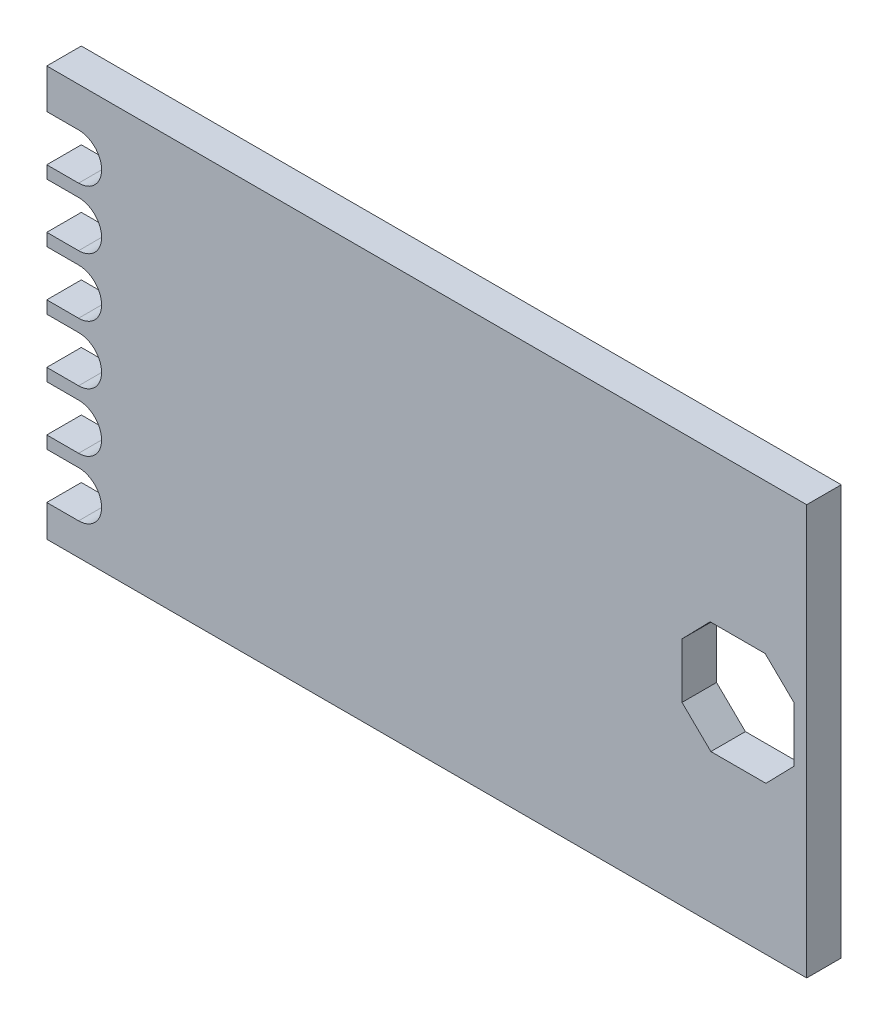
ISO-10303-21;
HEADER;
FILE_DESCRIPTION(('STEP AP214'),'2;1');
FILE_NAME('part.step','',(''),(''),'','','');
FILE_SCHEMA(('AUTOMOTIVE_DESIGN { 1 0 10303 214 1 1 1 1 }'));
ENDSEC;
DATA;
#1=APPLICATION_CONTEXT('core data for automotive mechanical design processes');
#2=APPLICATION_PROTOCOL_DEFINITION('international standard','automotive_design',2000,#1);
#3=PRODUCT_CONTEXT('',#1,'mechanical');
#4=PRODUCT('Part','Part','',(#3));
#5=PRODUCT_RELATED_PRODUCT_CATEGORY('part','',(#4));
#6=PRODUCT_DEFINITION_FORMATION('','',#4);
#7=PRODUCT_DEFINITION_CONTEXT('part definition',#1,'design');
#8=PRODUCT_DEFINITION('design','',#6,#7);
#9=PRODUCT_DEFINITION_SHAPE('','',#8);
#10=(LENGTH_UNIT() NAMED_UNIT(*) SI_UNIT(.MILLI.,.METRE.));
#11=(NAMED_UNIT(*) PLANE_ANGLE_UNIT() SI_UNIT($,.RADIAN.));
#12=(NAMED_UNIT(*) SI_UNIT($,.STERADIAN.) SOLID_ANGLE_UNIT());
#13=UNCERTAINTY_MEASURE_WITH_UNIT(LENGTH_MEASURE(1.E-05),#10,'distance_accuracy_value','');
#14=(GEOMETRIC_REPRESENTATION_CONTEXT(3) GLOBAL_UNCERTAINTY_ASSIGNED_CONTEXT((#13)) GLOBAL_UNIT_ASSIGNED_CONTEXT((#10,
#11,#12)) REPRESENTATION_CONTEXT('',''));
#15=CARTESIAN_POINT('',(0.,0.,0.));
#16=DIRECTION('',(0.,0.,1.));
#17=DIRECTION('',(1.,0.,0.));
#18=AXIS2_PLACEMENT_3D('',#15,#16,#17);
#19=CARTESIAN_POINT('',(0.,0.,1.5));
#20=DIRECTION('',(0.,0.,-1.));
#21=DIRECTION('',(-1.,0.,0.));
#22=AXIS2_PLACEMENT_3D('',#19,#20,#21);
#23=PLANE('',#22);
#24=DIRECTION('',(-1.,0.,0.));
#25=VECTOR('',#24,1.);
#26=CARTESIAN_POINT('',(0.,3.38416939249342,1.5));
#27=LINE('',#26,#25);
#28=CARTESIAN_POINT('',(1.38176013308562,3.38416939249342,1.5));
#29=VERTEX_POINT('',#28);
#30=CARTESIAN_POINT('',(0.,3.38416939249342,1.5));
#31=VERTEX_POINT('',#30);
#32=EDGE_CURVE('E326',#29,#31,#27,.T.);
#33=ORIENTED_EDGE('',*,*,#32,.F.);
#34=CARTESIAN_POINT('',(1.38176013308562,2.38416939249342,1.5));
#35=DIRECTION('',(0.,0.,-1.));
#36=DIRECTION('',(-1.,0.,0.));
#37=AXIS2_PLACEMENT_3D('',#34,#35,#36);
#38=CIRCLE('',#37,1.);
#39=CARTESIAN_POINT('',(1.38176013308562,1.38416939249342,1.5));
#40=VERTEX_POINT('',#39);
#41=EDGE_CURVE('E328',#29,#40,#38,.T.);
#42=ORIENTED_EDGE('',*,*,#41,.T.);
#43=DIRECTION('',(-1.,0.,0.));
#44=VECTOR('',#43,1.);
#45=CARTESIAN_POINT('',(0.,1.38416939249342,1.5));
#46=LINE('',#45,#44);
#47=CARTESIAN_POINT('',(0.,1.38416939249342,1.5));
#48=VERTEX_POINT('',#47);
#49=EDGE_CURVE('E322',#40,#48,#46,.T.);
#50=ORIENTED_EDGE('',*,*,#49,.T.);
#51=DIRECTION('',(0.,-1.,0.));
#52=VECTOR('',#51,1.);
#53=CARTESIAN_POINT('',(0.,0.,1.5));
#54=LINE('',#53,#52);
#55=CARTESIAN_POINT('',(0.,0.,1.5));
#56=VERTEX_POINT('',#55);
#57=EDGE_CURVE('E448',#48,#56,#54,.T.);
#58=ORIENTED_EDGE('',*,*,#57,.T.);
#59=DIRECTION('',(1.,0.,0.));
#60=VECTOR('',#59,1.);
#61=CARTESIAN_POINT('',(0.,0.,1.5));
#62=LINE('',#61,#60);
#63=CARTESIAN_POINT('',(33.,0.,1.5));
#64=VERTEX_POINT('',#63);
#65=EDGE_CURVE('E446',#56,#64,#62,.T.);
#66=ORIENTED_EDGE('',*,*,#65,.T.);
#67=DIRECTION('',(0.,1.,0.));
#68=VECTOR('',#67,1.);
#69=CARTESIAN_POINT('',(33.,0.,1.5));
#70=LINE('',#69,#68);
#71=CARTESIAN_POINT('',(33.,17.8,1.5));
#72=VERTEX_POINT('',#71);
#73=EDGE_CURVE('E450',#64,#72,#70,.T.);
#74=ORIENTED_EDGE('',*,*,#73,.T.);
#75=DIRECTION('',(-1.,0.,0.));
#76=VECTOR('',#75,1.);
#77=CARTESIAN_POINT('',(0.,17.8,1.5));
#78=LINE('',#77,#76);
#79=CARTESIAN_POINT('',(0.,17.8,1.5));
#80=VERTEX_POINT('',#79);
#81=EDGE_CURVE('E452',#72,#80,#78,.T.);
#82=ORIENTED_EDGE('',*,*,#81,.T.);
#83=CARTESIAN_POINT('',(0.,16.0841693924934,1.5));
#84=VERTEX_POINT('',#83);
#85=EDGE_CURVE('E443',#80,#84,#54,.T.);
#86=ORIENTED_EDGE('',*,*,#85,.T.);
#87=DIRECTION('',(1.,0.,0.));
#88=VECTOR('',#87,1.);
#89=CARTESIAN_POINT('',(0.,16.0841693924934,1.5));
#90=LINE('',#89,#88);
#91=CARTESIAN_POINT('',(1.38176013308566,16.0841693924934,1.5));
#92=VERTEX_POINT('',#91);
#93=EDGE_CURVE('E439',#84,#92,#90,.T.);
#94=ORIENTED_EDGE('',*,*,#93,.T.);
#95=CARTESIAN_POINT('',(1.38176013308567,15.0841693924934,1.5));
#96=DIRECTION('',(0.,0.,-1.));
#97=DIRECTION('',(-1.,0.,0.));
#98=AXIS2_PLACEMENT_3D('',#95,#96,#97);
#99=CIRCLE('',#98,1.);
#100=CARTESIAN_POINT('',(1.38176013308567,14.0841693924934,1.5));
#101=VERTEX_POINT('',#100);
#102=EDGE_CURVE('E437',#101,#92,#99,.F.);
#103=ORIENTED_EDGE('',*,*,#102,.F.);
#104=DIRECTION('',(1.,0.,0.));
#105=VECTOR('',#104,1.);
#106=CARTESIAN_POINT('',(0.,14.0841693924934,1.5));
#107=LINE('',#106,#105);
#108=CARTESIAN_POINT('',(0.,14.0841693924934,1.5));
#109=VERTEX_POINT('',#108);
#110=EDGE_CURVE('E420',#109,#101,#107,.T.);
#111=ORIENTED_EDGE('',*,*,#110,.F.);
#112=CARTESIAN_POINT('',(0.,13.5441693924934,1.5));
#113=VERTEX_POINT('',#112);
#114=EDGE_CURVE('E447',#109,#113,#54,.T.);
#115=ORIENTED_EDGE('',*,*,#114,.T.);
#116=DIRECTION('',(-1.,0.,0.));
#117=VECTOR('',#116,1.);
#118=CARTESIAN_POINT('',(0.,13.5441693924934,1.5));
#119=LINE('',#118,#117);
#120=CARTESIAN_POINT('',(1.38176013308566,13.5441693924934,1.5));
#121=VERTEX_POINT('',#120);
#122=EDGE_CURVE('E415',#121,#113,#119,.T.);
#123=ORIENTED_EDGE('',*,*,#122,.F.);
#124=CARTESIAN_POINT('',(1.38176013308566,12.5441693924934,1.5));
#125=DIRECTION('',(0.,0.,-1.));
#126=DIRECTION('',(-1.,0.,0.));
#127=AXIS2_PLACEMENT_3D('',#124,#125,#126);
#128=CIRCLE('',#127,1.);
#129=CARTESIAN_POINT('',(1.38176013308566,11.5441693924934,1.5));
#130=VERTEX_POINT('',#129);
#131=EDGE_CURVE('E402',#121,#130,#128,.T.);
#132=ORIENTED_EDGE('',*,*,#131,.T.);
#133=DIRECTION('',(-1.,0.,0.));
#134=VECTOR('',#133,1.);
#135=CARTESIAN_POINT('',(0.,11.5441693924934,1.5));
#136=LINE('',#135,#134);
#137=CARTESIAN_POINT('',(0.,11.5441693924934,1.5));
#138=VERTEX_POINT('',#137);
#139=EDGE_CURVE('E412',#130,#138,#136,.T.);
#140=ORIENTED_EDGE('',*,*,#139,.T.);
#141=CARTESIAN_POINT('',(0.,11.0041693924934,1.5));
#142=VERTEX_POINT('',#141);
#143=EDGE_CURVE('E629',#138,#142,#54,.T.);
#144=ORIENTED_EDGE('',*,*,#143,.T.);
#145=DIRECTION('',(-1.,0.,0.));
#146=VECTOR('',#145,1.);
#147=CARTESIAN_POINT('',(0.,11.0041693924934,1.5));
#148=LINE('',#147,#146);
#149=CARTESIAN_POINT('',(1.38176013308565,11.0041693924934,1.5));
#150=VERTEX_POINT('',#149);
#151=EDGE_CURVE('E386',#150,#142,#148,.T.);
#152=ORIENTED_EDGE('',*,*,#151,.F.);
#153=CARTESIAN_POINT('',(1.38176013308565,10.0041693924934,1.5));
#154=DIRECTION('',(0.,0.,-1.));
#155=DIRECTION('',(-1.,0.,0.));
#156=AXIS2_PLACEMENT_3D('',#153,#154,#155);
#157=CIRCLE('',#156,1.);
#158=CARTESIAN_POINT('',(1.38176013308565,9.00416939249342,1.5));
#159=VERTEX_POINT('',#158);
#160=EDGE_CURVE('E388',#150,#159,#157,.T.);
#161=ORIENTED_EDGE('',*,*,#160,.T.);
#162=DIRECTION('',(-1.,0.,0.));
#163=VECTOR('',#162,1.);
#164=CARTESIAN_POINT('',(0.,9.00416939249342,1.5));
#165=LINE('',#164,#163);
#166=CARTESIAN_POINT('',(0.,9.00416939249342,1.5));
#167=VERTEX_POINT('',#166);
#168=EDGE_CURVE('E382',#159,#167,#165,.T.);
#169=ORIENTED_EDGE('',*,*,#168,.T.);
#170=CARTESIAN_POINT('',(0.,8.46416939249342,1.5));
#171=VERTEX_POINT('',#170);
#172=EDGE_CURVE('E630',#167,#171,#54,.T.);
#173=ORIENTED_EDGE('',*,*,#172,.T.);
#174=DIRECTION('',(-1.,0.,0.));
#175=VECTOR('',#174,1.);
#176=CARTESIAN_POINT('',(0.,8.46416939249342,1.5));
#177=LINE('',#176,#175);
#178=CARTESIAN_POINT('',(1.38176013308564,8.46416939249342,1.5));
#179=VERTEX_POINT('',#178);
#180=EDGE_CURVE('E366',#179,#171,#177,.T.);
#181=ORIENTED_EDGE('',*,*,#180,.F.);
#182=CARTESIAN_POINT('',(1.38176013308564,7.46416939249342,1.5));
#183=DIRECTION('',(0.,0.,-1.));
#184=DIRECTION('',(-1.,0.,0.));
#185=AXIS2_PLACEMENT_3D('',#182,#183,#184);
#186=CIRCLE('',#185,1.);
#187=CARTESIAN_POINT('',(1.38176013308564,6.46416939249342,1.5));
#188=VERTEX_POINT('',#187);
#189=EDGE_CURVE('E368',#179,#188,#186,.T.);
#190=ORIENTED_EDGE('',*,*,#189,.T.);
#191=DIRECTION('',(-1.,0.,0.));
#192=VECTOR('',#191,1.);
#193=CARTESIAN_POINT('',(0.,6.46416939249342,1.5));
#194=LINE('',#193,#192);
#195=CARTESIAN_POINT('',(0.,6.46416939249342,1.5));
#196=VERTEX_POINT('',#195);
#197=EDGE_CURVE('E362',#188,#196,#194,.T.);
#198=ORIENTED_EDGE('',*,*,#197,.T.);
#199=CARTESIAN_POINT('',(0.,5.92416939249342,1.5));
#200=VERTEX_POINT('',#199);
#201=EDGE_CURVE('E633',#196,#200,#54,.T.);
#202=ORIENTED_EDGE('',*,*,#201,.T.);
#203=DIRECTION('',(-1.,0.,0.));
#204=VECTOR('',#203,1.);
#205=CARTESIAN_POINT('',(0.,5.92416939249342,1.5));
#206=LINE('',#205,#204);
#207=CARTESIAN_POINT('',(1.38176013308563,5.92416939249342,1.5));
#208=VERTEX_POINT('',#207);
#209=EDGE_CURVE('E346',#208,#200,#206,.T.);
#210=ORIENTED_EDGE('',*,*,#209,.F.);
#211=CARTESIAN_POINT('',(1.38176013308563,4.92416939249342,1.5));
#212=DIRECTION('',(0.,0.,-1.));
#213=DIRECTION('',(-1.,0.,0.));
#214=AXIS2_PLACEMENT_3D('',#211,#212,#213);
#215=CIRCLE('',#214,1.);
#216=CARTESIAN_POINT('',(1.38176013308563,3.92416939249342,1.5));
#217=VERTEX_POINT('',#216);
#218=EDGE_CURVE('E348',#208,#217,#215,.T.);
#219=ORIENTED_EDGE('',*,*,#218,.T.);
#220=DIRECTION('',(-1.,0.,0.));
#221=VECTOR('',#220,1.);
#222=CARTESIAN_POINT('',(0.,3.92416939249342,1.5));
#223=LINE('',#222,#221);
#224=CARTESIAN_POINT('',(0.,3.92416939249342,1.5));
#225=VERTEX_POINT('',#224);
#226=EDGE_CURVE('E342',#217,#225,#223,.T.);
#227=ORIENTED_EDGE('',*,*,#226,.T.);
#228=EDGE_CURVE('E637',#225,#31,#54,.T.);
#229=ORIENTED_EDGE('',*,*,#228,.T.);
#230=EDGE_LOOP('',(#33,#42,#50,#58,#66,#74,#82,#86,#94,#103,#111,#115,#123,#132,#140,#144,#152,
#161,#169,#173,#181,#190,#198,#202,#210,#219,#227,#229));
#231=FACE_BOUND('',#230,.T.);
#232=DIRECTION('',(-0.697780575083329,-0.716311572596994,0.));
#233=VECTOR('',#232,1.);
#234=CARTESIAN_POINT('',(31.2288839936042,6.43562770116437,1.5));
#235=LINE('',#234,#233);
#236=CARTESIAN_POINT('',(32.45,7.68917295320911,1.5));
#237=VERTEX_POINT('',#236);
#238=CARTESIAN_POINT('',(31.2288839936042,6.43562770116437,1.5));
#239=VERTEX_POINT('',#238);
#240=EDGE_CURVE('E48',#237,#239,#235,.T.);
#241=ORIENTED_EDGE('',*,*,#240,.T.);
#242=DIRECTION('',(-1.,0.,0.));
#243=VECTOR('',#242,1.);
#244=CARTESIAN_POINT('',(28.8391729532091,6.43562770116437,1.5));
#245=LINE('',#244,#243);
#246=CARTESIAN_POINT('',(28.8391729532091,6.43562770116437,1.5));
#247=VERTEX_POINT('',#246);
#248=EDGE_CURVE('E274',#239,#247,#245,.T.);
#249=ORIENTED_EDGE('',*,*,#248,.T.);
#250=DIRECTION('',(-0.716311572596995,0.697780575083328,0.));
#251=VECTOR('',#250,1.);
#252=CARTESIAN_POINT('',(28.8391729532091,6.43562770116437,1.5));
#253=LINE('',#252,#251);
#254=CARTESIAN_POINT('',(27.5856277011644,7.65674370756019,1.5));
#255=VERTEX_POINT('',#254);
#256=EDGE_CURVE('E280',#247,#255,#253,.T.);
#257=ORIENTED_EDGE('',*,*,#256,.T.);
#258=DIRECTION('',(0.,1.,0.));
#259=VECTOR('',#258,1.);
#260=CARTESIAN_POINT('',(27.5856277011644,7.65674370756019,1.5));
#261=LINE('',#260,#259);
#262=CARTESIAN_POINT('',(27.5856277011644,10.0464547479553,1.5));
#263=VERTEX_POINT('',#262);
#264=EDGE_CURVE('E288',#255,#263,#261,.T.);
#265=ORIENTED_EDGE('',*,*,#264,.T.);
#266=DIRECTION('',(0.697780575083328,0.716311572596995,0.));
#267=VECTOR('',#266,1.);
#268=CARTESIAN_POINT('',(28.8067437075602,11.3,1.5));
#269=LINE('',#268,#267);
#270=CARTESIAN_POINT('',(28.8067437075602,11.3,1.5));
#271=VERTEX_POINT('',#270);
#272=EDGE_CURVE('E291',#263,#271,#269,.T.);
#273=ORIENTED_EDGE('',*,*,#272,.T.);
#274=DIRECTION('',(1.,0.,0.));
#275=VECTOR('',#274,1.);
#276=CARTESIAN_POINT('',(28.8067437075602,11.3,1.5));
#277=LINE('',#276,#275);
#278=CARTESIAN_POINT('',(31.1964547479553,11.3,1.5));
#279=VERTEX_POINT('',#278);
#280=EDGE_CURVE('E294',#271,#279,#277,.T.);
#281=ORIENTED_EDGE('',*,*,#280,.T.);
#282=DIRECTION('',(0.716311572596994,-0.697780575083329,0.));
#283=VECTOR('',#282,1.);
#284=CARTESIAN_POINT('',(32.45,10.0788839936042,1.5));
#285=LINE('',#284,#283);
#286=CARTESIAN_POINT('',(32.45,10.0788839936042,1.5));
#287=VERTEX_POINT('',#286);
#288=EDGE_CURVE('E297',#279,#287,#285,.T.);
#289=ORIENTED_EDGE('',*,*,#288,.T.);
#290=DIRECTION('',(0.,-1.,0.));
#291=VECTOR('',#290,1.);
#292=CARTESIAN_POINT('',(32.45,7.68917295320911,1.5));
#293=LINE('',#292,#291);
#294=EDGE_CURVE('E284',#287,#237,#293,.T.);
#295=ORIENTED_EDGE('',*,*,#294,.T.);
#296=EDGE_LOOP('',(#241,#249,#257,#265,#273,#281,#289,#295));
#297=FACE_BOUND('',#296,.T.);
#298=ADVANCED_FACE('F33',(#231,#297),#23,.F.);
#299=CARTESIAN_POINT('',(0.,0.,0.));
#300=DIRECTION('',(0.,0.,-1.));
#301=DIRECTION('',(-1.,0.,0.));
#302=AXIS2_PLACEMENT_3D('',#299,#300,#301);
#303=PLANE('',#302);
#304=CARTESIAN_POINT('',(1.38176013308562,2.38416939249342,0.));
#305=DIRECTION('',(0.,0.,-1.));
#306=DIRECTION('',(-1.,0.,0.));
#307=AXIS2_PLACEMENT_3D('',#304,#305,#306);
#308=CIRCLE('',#307,1.);
#309=CARTESIAN_POINT('',(1.38176013308562,3.38416939249342,0.));
#310=VERTEX_POINT('',#309);
#311=CARTESIAN_POINT('',(1.38176013308562,1.38416939249342,0.));
#312=VERTEX_POINT('',#311);
#313=EDGE_CURVE('E315',#310,#312,#308,.T.);
#314=ORIENTED_EDGE('',*,*,#313,.F.);
#315=DIRECTION('',(-1.,0.,0.));
#316=VECTOR('',#315,1.);
#317=CARTESIAN_POINT('',(0.,3.38416939249342,0.));
#318=LINE('',#317,#316);
#319=CARTESIAN_POINT('',(0.,3.38416939249342,0.));
#320=VERTEX_POINT('',#319);
#321=EDGE_CURVE('E270',#310,#320,#318,.T.);
#322=ORIENTED_EDGE('',*,*,#321,.T.);
#323=DIRECTION('',(0.,-1.,0.));
#324=VECTOR('',#323,1.);
#325=CARTESIAN_POINT('',(0.,0.,0.));
#326=LINE('',#325,#324);
#327=CARTESIAN_POINT('',(0.,3.92416939249342,0.));
#328=VERTEX_POINT('',#327);
#329=EDGE_CURVE('E587',#328,#320,#326,.T.);
#330=ORIENTED_EDGE('',*,*,#329,.F.);
#331=DIRECTION('',(-1.,0.,0.));
#332=VECTOR('',#331,1.);
#333=CARTESIAN_POINT('',(0.,3.92416939249342,0.));
#334=LINE('',#333,#332);
#335=CARTESIAN_POINT('',(1.38176013308563,3.92416939249342,0.));
#336=VERTEX_POINT('',#335);
#337=EDGE_CURVE('E332',#336,#328,#334,.T.);
#338=ORIENTED_EDGE('',*,*,#337,.F.);
#339=CARTESIAN_POINT('',(1.38176013308563,4.92416939249342,0.));
#340=DIRECTION('',(0.,0.,-1.));
#341=DIRECTION('',(-1.,0.,0.));
#342=AXIS2_PLACEMENT_3D('',#339,#340,#341);
#343=CIRCLE('',#342,1.);
#344=CARTESIAN_POINT('',(1.38176013308563,5.92416939249342,0.));
#345=VERTEX_POINT('',#344);
#346=EDGE_CURVE('E335',#345,#336,#343,.T.);
#347=ORIENTED_EDGE('',*,*,#346,.F.);
#348=DIRECTION('',(-1.,0.,0.));
#349=VECTOR('',#348,1.);
#350=CARTESIAN_POINT('',(0.,5.92416939249342,0.));
#351=LINE('',#350,#349);
#352=CARTESIAN_POINT('',(0.,5.92416939249342,0.));
#353=VERTEX_POINT('',#352);
#354=EDGE_CURVE('E331',#345,#353,#351,.T.);
#355=ORIENTED_EDGE('',*,*,#354,.T.);
#356=CARTESIAN_POINT('',(0.,6.46416939249342,0.));
#357=VERTEX_POINT('',#356);
#358=EDGE_CURVE('E589',#357,#353,#326,.T.);
#359=ORIENTED_EDGE('',*,*,#358,.F.);
#360=DIRECTION('',(-1.,0.,0.));
#361=VECTOR('',#360,1.);
#362=CARTESIAN_POINT('',(0.,6.46416939249342,0.));
#363=LINE('',#362,#361);
#364=CARTESIAN_POINT('',(1.38176013308564,6.46416939249342,0.));
#365=VERTEX_POINT('',#364);
#366=EDGE_CURVE('E352',#365,#357,#363,.T.);
#367=ORIENTED_EDGE('',*,*,#366,.F.);
#368=CARTESIAN_POINT('',(1.38176013308564,7.46416939249342,0.));
#369=DIRECTION('',(0.,0.,-1.));
#370=DIRECTION('',(-1.,0.,0.));
#371=AXIS2_PLACEMENT_3D('',#368,#369,#370);
#372=CIRCLE('',#371,1.);
#373=CARTESIAN_POINT('',(1.38176013308564,8.46416939249342,0.));
#374=VERTEX_POINT('',#373);
#375=EDGE_CURVE('E355',#374,#365,#372,.T.);
#376=ORIENTED_EDGE('',*,*,#375,.F.);
#377=DIRECTION('',(-1.,0.,0.));
#378=VECTOR('',#377,1.);
#379=CARTESIAN_POINT('',(0.,8.46416939249342,0.));
#380=LINE('',#379,#378);
#381=CARTESIAN_POINT('',(0.,8.46416939249342,0.));
#382=VERTEX_POINT('',#381);
#383=EDGE_CURVE('E351',#374,#382,#380,.T.);
#384=ORIENTED_EDGE('',*,*,#383,.T.);
#385=CARTESIAN_POINT('',(0.,9.00416939249342,0.));
#386=VERTEX_POINT('',#385);
#387=EDGE_CURVE('E594',#386,#382,#326,.T.);
#388=ORIENTED_EDGE('',*,*,#387,.F.);
#389=DIRECTION('',(-1.,0.,0.));
#390=VECTOR('',#389,1.);
#391=CARTESIAN_POINT('',(0.,9.00416939249342,0.));
#392=LINE('',#391,#390);
#393=CARTESIAN_POINT('',(1.38176013308565,9.00416939249342,0.));
#394=VERTEX_POINT('',#393);
#395=EDGE_CURVE('E372',#394,#386,#392,.T.);
#396=ORIENTED_EDGE('',*,*,#395,.F.);
#397=CARTESIAN_POINT('',(1.38176013308565,10.0041693924934,0.));
#398=DIRECTION('',(0.,0.,-1.));
#399=DIRECTION('',(-1.,0.,0.));
#400=AXIS2_PLACEMENT_3D('',#397,#398,#399);
#401=CIRCLE('',#400,1.);
#402=CARTESIAN_POINT('',(1.38176013308565,11.0041693924934,0.));
#403=VERTEX_POINT('',#402);
#404=EDGE_CURVE('E375',#403,#394,#401,.T.);
#405=ORIENTED_EDGE('',*,*,#404,.F.);
#406=DIRECTION('',(-1.,0.,0.));
#407=VECTOR('',#406,1.);
#408=CARTESIAN_POINT('',(0.,11.0041693924934,0.));
#409=LINE('',#408,#407);
#410=CARTESIAN_POINT('',(0.,11.0041693924934,0.));
#411=VERTEX_POINT('',#410);
#412=EDGE_CURVE('E371',#403,#411,#409,.T.);
#413=ORIENTED_EDGE('',*,*,#412,.T.);
#414=CARTESIAN_POINT('',(0.,11.5441693924934,0.));
#415=VERTEX_POINT('',#414);
#416=EDGE_CURVE('E599',#415,#411,#326,.T.);
#417=ORIENTED_EDGE('',*,*,#416,.F.);
#418=DIRECTION('',(-1.,0.,0.));
#419=VECTOR('',#418,1.);
#420=CARTESIAN_POINT('',(0.,11.5441693924934,0.));
#421=LINE('',#420,#419);
#422=CARTESIAN_POINT('',(1.38176013308566,11.5441693924934,0.));
#423=VERTEX_POINT('',#422);
#424=EDGE_CURVE('E392',#423,#415,#421,.T.);
#425=ORIENTED_EDGE('',*,*,#424,.F.);
#426=CARTESIAN_POINT('',(1.38176013308566,12.5441693924934,0.));
#427=DIRECTION('',(0.,0.,-1.));
#428=DIRECTION('',(-1.,0.,0.));
#429=AXIS2_PLACEMENT_3D('',#426,#427,#428);
#430=CIRCLE('',#429,1.);
#431=CARTESIAN_POINT('',(1.38176013308566,13.5441693924934,0.));
#432=VERTEX_POINT('',#431);
#433=EDGE_CURVE('E395',#432,#423,#430,.T.);
#434=ORIENTED_EDGE('',*,*,#433,.F.);
#435=DIRECTION('',(-1.,0.,0.));
#436=VECTOR('',#435,1.);
#437=CARTESIAN_POINT('',(0.,13.5441693924934,0.));
#438=LINE('',#437,#436);
#439=CARTESIAN_POINT('',(0.,13.5441693924934,0.));
#440=VERTEX_POINT('',#439);
#441=EDGE_CURVE('E391',#432,#440,#438,.T.);
#442=ORIENTED_EDGE('',*,*,#441,.T.);
#443=CARTESIAN_POINT('',(0.,14.0841693924934,0.));
#444=VERTEX_POINT('',#443);
#445=EDGE_CURVE('E459',#444,#440,#326,.T.);
#446=ORIENTED_EDGE('',*,*,#445,.F.);
#447=DIRECTION('',(-1.,0.,0.));
#448=VECTOR('',#447,1.);
#449=CARTESIAN_POINT('',(0.,14.0841693924934,0.));
#450=LINE('',#449,#448);
#451=CARTESIAN_POINT('',(1.38176013308567,14.0841693924934,0.));
#452=VERTEX_POINT('',#451);
#453=EDGE_CURVE('E418',#452,#444,#450,.T.);
#454=ORIENTED_EDGE('',*,*,#453,.F.);
#455=CARTESIAN_POINT('',(1.38176013308567,15.0841693924934,0.));
#456=DIRECTION('',(0.,0.,-1.));
#457=DIRECTION('',(-1.,0.,0.));
#458=AXIS2_PLACEMENT_3D('',#455,#456,#457);
#459=CIRCLE('',#458,1.);
#460=CARTESIAN_POINT('',(1.38176013308566,16.0841693924934,0.));
#461=VERTEX_POINT('',#460);
#462=EDGE_CURVE('E421',#461,#452,#459,.T.);
#463=ORIENTED_EDGE('',*,*,#462,.F.);
#464=DIRECTION('',(-1.,0.,0.));
#465=VECTOR('',#464,1.);
#466=CARTESIAN_POINT('',(0.,16.0841693924934,0.));
#467=LINE('',#466,#465);
#468=CARTESIAN_POINT('',(0.,16.0841693924934,0.));
#469=VERTEX_POINT('',#468);
#470=EDGE_CURVE('E417',#461,#469,#467,.T.);
#471=ORIENTED_EDGE('',*,*,#470,.T.);
#472=CARTESIAN_POINT('',(0.,17.8,0.));
#473=VERTEX_POINT('',#472);
#474=EDGE_CURVE('E455',#473,#469,#326,.T.);
#475=ORIENTED_EDGE('',*,*,#474,.F.);
#476=DIRECTION('',(-1.,0.,0.));
#477=VECTOR('',#476,1.);
#478=CARTESIAN_POINT('',(0.,17.8,0.));
#479=LINE('',#478,#477);
#480=CARTESIAN_POINT('',(33.,17.8,0.));
#481=VERTEX_POINT('',#480);
#482=EDGE_CURVE('E463',#481,#473,#479,.T.);
#483=ORIENTED_EDGE('',*,*,#482,.F.);
#484=DIRECTION('',(0.,1.,0.));
#485=VECTOR('',#484,1.);
#486=CARTESIAN_POINT('',(33.,0.,0.));
#487=LINE('',#486,#485);
#488=CARTESIAN_POINT('',(33.,0.,0.));
#489=VERTEX_POINT('',#488);
#490=EDGE_CURVE('E461',#489,#481,#487,.T.);
#491=ORIENTED_EDGE('',*,*,#490,.F.);
#492=DIRECTION('',(1.,0.,0.));
#493=VECTOR('',#492,1.);
#494=CARTESIAN_POINT('',(0.,0.,0.));
#495=LINE('',#494,#493);
#496=CARTESIAN_POINT('',(0.,0.,0.));
#497=VERTEX_POINT('',#496);
#498=EDGE_CURVE('E458',#497,#489,#495,.T.);
#499=ORIENTED_EDGE('',*,*,#498,.F.);
#500=CARTESIAN_POINT('',(0.,1.38416939249342,0.));
#501=VERTEX_POINT('',#500);
#502=EDGE_CURVE('E442',#501,#497,#326,.T.);
#503=ORIENTED_EDGE('',*,*,#502,.F.);
#504=DIRECTION('',(-1.,0.,0.));
#505=VECTOR('',#504,1.);
#506=CARTESIAN_POINT('',(0.,1.38416939249342,0.));
#507=LINE('',#506,#505);
#508=EDGE_CURVE('E312',#312,#501,#507,.T.);
#509=ORIENTED_EDGE('',*,*,#508,.F.);
#510=EDGE_LOOP('',(#314,#322,#330,#338,#347,#355,#359,#367,#376,#384,#388,#396,#405,#413,#417,
#425,#434,#442,#446,#454,#463,#471,#475,#483,#491,#499,#503,#509));
#511=FACE_BOUND('',#510,.T.);
#512=DIRECTION('',(1.,0.,0.));
#513=VECTOR('',#512,1.);
#514=CARTESIAN_POINT('',(0.,6.43562770116437,0.));
#515=LINE('',#514,#513);
#516=CARTESIAN_POINT('',(28.8391729532091,6.43562770116437,0.));
#517=VERTEX_POINT('',#516);
#518=CARTESIAN_POINT('',(31.2288839936042,6.43562770116437,0.));
#519=VERTEX_POINT('',#518);
#520=EDGE_CURVE('E41',#517,#519,#515,.T.);
#521=ORIENTED_EDGE('',*,*,#520,.T.);
#522=DIRECTION('',(0.697780575083329,0.716311572596994,0.));
#523=VECTOR('',#522,1.);
#524=CARTESIAN_POINT('',(12.8069023764286,-12.4755875056735,0.));
#525=LINE('',#524,#523);
#526=CARTESIAN_POINT('',(32.45,7.68917295320911,0.));
#527=VERTEX_POINT('',#526);
#528=EDGE_CURVE('E11',#519,#527,#525,.T.);
#529=ORIENTED_EDGE('',*,*,#528,.T.);
#530=DIRECTION('',(0.,1.,0.));
#531=VECTOR('',#530,1.);
#532=CARTESIAN_POINT('',(32.45,0.,0.));
#533=LINE('',#532,#531);
#534=CARTESIAN_POINT('',(32.45,10.0788839936042,0.));
#535=VERTEX_POINT('',#534);
#536=EDGE_CURVE('E496',#527,#535,#533,.T.);
#537=ORIENTED_EDGE('',*,*,#536,.T.);
#538=DIRECTION('',(-0.716311572596994,0.697780575083329,0.));
#539=VECTOR('',#538,1.);
#540=CARTESIAN_POINT('',(20.8375428329297,21.3909266160506,0.));
#541=LINE('',#540,#539);
#542=CARTESIAN_POINT('',(31.1964547479553,11.3,0.));
#543=VERTEX_POINT('',#542);
#544=EDGE_CURVE('E499',#535,#543,#541,.T.);
#545=ORIENTED_EDGE('',*,*,#544,.T.);
#546=DIRECTION('',(-1.,0.,0.));
#547=VECTOR('',#546,1.);
#548=CARTESIAN_POINT('',(0.,11.3,0.));
#549=LINE('',#548,#547);
#550=CARTESIAN_POINT('',(28.8067437075602,11.3,0.));
#551=VERTEX_POINT('',#550);
#552=EDGE_CURVE('E502',#543,#551,#549,.T.);
#553=ORIENTED_EDGE('',*,*,#552,.T.);
#554=DIRECTION('',(-0.697780575083328,-0.716311572596995,0.));
#555=VECTOR('',#554,1.);
#556=CARTESIAN_POINT('',(9.13274575785762,-8.89648140669233,0.));
#557=LINE('',#556,#555);
#558=CARTESIAN_POINT('',(27.5856277011644,10.0464547479553,0.));
#559=VERTEX_POINT('',#558);
#560=EDGE_CURVE('E505',#551,#559,#557,.T.);
#561=ORIENTED_EDGE('',*,*,#560,.T.);
#562=DIRECTION('',(0.,-1.,0.));
#563=VECTOR('',#562,1.);
#564=CARTESIAN_POINT('',(27.5856277011644,0.,0.));
#565=LINE('',#564,#563);
#566=CARTESIAN_POINT('',(27.5856277011644,7.65674370756019,0.));
#567=VERTEX_POINT('',#566);
#568=EDGE_CURVE('E508',#559,#567,#565,.T.);
#569=ORIENTED_EDGE('',*,*,#568,.T.);
#570=DIRECTION('',(0.716311572596995,-0.697780575083328,0.));
#571=VECTOR('',#570,1.);
#572=CARTESIAN_POINT('',(17.2584367339485,17.7167699974796,0.));
#573=LINE('',#572,#571);
#574=EDGE_CURVE('E511',#567,#517,#573,.T.);
#575=ORIENTED_EDGE('',*,*,#574,.T.);
#576=EDGE_LOOP('',(#521,#529,#537,#545,#553,#561,#569,#575));
#577=FACE_BOUND('',#576,.T.);
#578=ADVANCED_FACE('F514',(#511,#577),#303,.T.);
#579=CARTESIAN_POINT('',(0.,0.,1.5));
#580=DIRECTION('',(1.,0.,0.));
#581=DIRECTION('',(0.,0.,-1.));
#582=AXIS2_PLACEMENT_3D('',#579,#580,#581);
#583=PLANE('',#582);
#584=DIRECTION('',(0.,0.,-1.));
#585=VECTOR('',#584,1.);
#586=CARTESIAN_POINT('',(0.,3.38416939249342,1.5));
#587=LINE('',#586,#585);
#588=EDGE_CURVE('E494',#31,#320,#587,.T.);
#589=ORIENTED_EDGE('',*,*,#588,.F.);
#590=ORIENTED_EDGE('',*,*,#228,.F.);
#591=DIRECTION('',(0.,0.,-1.));
#592=VECTOR('',#591,1.);
#593=CARTESIAN_POINT('',(0.,3.92416939249342,1.5));
#594=LINE('',#593,#592);
#595=EDGE_CURVE('E486',#225,#328,#594,.T.);
#596=ORIENTED_EDGE('',*,*,#595,.T.);
#597=ORIENTED_EDGE('',*,*,#329,.T.);
#598=EDGE_LOOP('',(#589,#590,#596,#597));
#599=FACE_BOUND('',#598,.T.);
#600=ADVANCED_FACE('F546',(#599),#583,.F.);
#601=DIRECTION('',(0.,0.,-1.));
#602=VECTOR('',#601,1.);
#603=CARTESIAN_POINT('',(0.,5.92416939249342,1.5));
#604=LINE('',#603,#602);
#605=EDGE_CURVE('E489',#200,#353,#604,.T.);
#606=ORIENTED_EDGE('',*,*,#605,.F.);
#607=ORIENTED_EDGE('',*,*,#201,.F.);
#608=DIRECTION('',(0.,0.,-1.));
#609=VECTOR('',#608,1.);
#610=CARTESIAN_POINT('',(0.,6.46416939249342,1.5));
#611=LINE('',#610,#609);
#612=EDGE_CURVE('E481',#196,#357,#611,.T.);
#613=ORIENTED_EDGE('',*,*,#612,.T.);
#614=ORIENTED_EDGE('',*,*,#358,.T.);
#615=EDGE_LOOP('',(#606,#607,#613,#614));
#616=FACE_BOUND('',#615,.T.);
#617=ADVANCED_FACE('F773',(#616),#583,.F.);
#618=DIRECTION('',(0.,0.,-1.));
#619=VECTOR('',#618,1.);
#620=CARTESIAN_POINT('',(0.,8.46416939249342,1.5));
#621=LINE('',#620,#619);
#622=EDGE_CURVE('E484',#171,#382,#621,.T.);
#623=ORIENTED_EDGE('',*,*,#622,.F.);
#624=ORIENTED_EDGE('',*,*,#172,.F.);
#625=DIRECTION('',(0.,0.,-1.));
#626=VECTOR('',#625,1.);
#627=CARTESIAN_POINT('',(0.,9.00416939249342,1.5));
#628=LINE('',#627,#626);
#629=EDGE_CURVE('E476',#167,#386,#628,.T.);
#630=ORIENTED_EDGE('',*,*,#629,.T.);
#631=ORIENTED_EDGE('',*,*,#387,.T.);
#632=EDGE_LOOP('',(#623,#624,#630,#631));
#633=FACE_BOUND('',#632,.T.);
#634=ADVANCED_FACE('F765',(#633),#583,.F.);
#635=DIRECTION('',(0.,0.,-1.));
#636=VECTOR('',#635,1.);
#637=CARTESIAN_POINT('',(0.,11.0041693924934,1.5));
#638=LINE('',#637,#636);
#639=EDGE_CURVE('E479',#142,#411,#638,.T.);
#640=ORIENTED_EDGE('',*,*,#639,.F.);
#641=ORIENTED_EDGE('',*,*,#143,.F.);
#642=DIRECTION('',(0.,0.,-1.));
#643=VECTOR('',#642,1.);
#644=CARTESIAN_POINT('',(0.,11.5441693924934,11.5));
#645=LINE('',#644,#643);
#646=EDGE_CURVE('E403',#138,#415,#645,.T.);
#647=ORIENTED_EDGE('',*,*,#646,.T.);
#648=ORIENTED_EDGE('',*,*,#416,.T.);
#649=EDGE_LOOP('',(#640,#641,#647,#648));
#650=FACE_BOUND('',#649,.T.);
#651=ADVANCED_FACE('F757',(#650),#583,.F.);
#652=DIRECTION('',(0.,0.,-1.));
#653=VECTOR('',#652,1.);
#654=CARTESIAN_POINT('',(0.,13.5441693924934,11.5));
#655=LINE('',#654,#653);
#656=EDGE_CURVE('E400',#113,#440,#655,.T.);
#657=ORIENTED_EDGE('',*,*,#656,.F.);
#658=ORIENTED_EDGE('',*,*,#114,.F.);
#659=DIRECTION('',(0.,0.,1.));
#660=VECTOR('',#659,1.);
#661=CARTESIAN_POINT('',(0.,14.0841693924934,-3.11010953690642));
#662=LINE('',#661,#660);
#663=EDGE_CURVE('E423',#444,#109,#662,.T.);
#664=ORIENTED_EDGE('',*,*,#663,.F.);
#665=ORIENTED_EDGE('',*,*,#445,.T.);
#666=EDGE_LOOP('',(#657,#658,#664,#665));
#667=FACE_BOUND('',#666,.T.);
#668=ADVANCED_FACE('F612',(#667),#583,.F.);
#669=ORIENTED_EDGE('',*,*,#57,.F.);
#670=DIRECTION('',(0.,0.,-1.));
#671=VECTOR('',#670,1.);
#672=CARTESIAN_POINT('',(0.,1.38416939249342,1.5));
#673=LINE('',#672,#671);
#674=EDGE_CURVE('E491',#48,#501,#673,.T.);
#675=ORIENTED_EDGE('',*,*,#674,.T.);
#676=ORIENTED_EDGE('',*,*,#502,.T.);
#677=DIRECTION('',(0.,0.,-1.));
#678=VECTOR('',#677,1.);
#679=CARTESIAN_POINT('',(0.,0.,1.5));
#680=LINE('',#679,#678);
#681=EDGE_CURVE('E473',#56,#497,#680,.T.);
#682=ORIENTED_EDGE('',*,*,#681,.F.);
#683=EDGE_LOOP('',(#669,#675,#676,#682));
#684=FACE_BOUND('',#683,.T.);
#685=ADVANCED_FACE('F567',(#684),#583,.F.);
#686=ORIENTED_EDGE('',*,*,#474,.T.);
#687=DIRECTION('',(0.,0.,1.));
#688=VECTOR('',#687,1.);
#689=CARTESIAN_POINT('',(0.,16.0841693924934,-3.11010953690642));
#690=LINE('',#689,#688);
#691=EDGE_CURVE('E426',#469,#84,#690,.T.);
#692=ORIENTED_EDGE('',*,*,#691,.T.);
#693=ORIENTED_EDGE('',*,*,#85,.F.);
#694=DIRECTION('',(0.,0.,-1.));
#695=VECTOR('',#694,1.);
#696=CARTESIAN_POINT('',(0.,17.8,1.5));
#697=LINE('',#696,#695);
#698=EDGE_CURVE('E454',#80,#473,#697,.T.);
#699=ORIENTED_EDGE('',*,*,#698,.T.);
#700=EDGE_LOOP('',(#686,#692,#693,#699));
#701=FACE_BOUND('',#700,.T.);
#702=ADVANCED_FACE('F35',(#701),#583,.F.);
#703=CARTESIAN_POINT('',(0.,0.,1.5));
#704=DIRECTION('',(0.,1.,0.));
#705=DIRECTION('',(0.,0.,1.));
#706=AXIS2_PLACEMENT_3D('',#703,#704,#705);
#707=PLANE('',#706);
#708=ORIENTED_EDGE('',*,*,#498,.T.);
#709=DIRECTION('',(0.,0.,-1.));
#710=VECTOR('',#709,1.);
#711=CARTESIAN_POINT('',(33.,0.,1.5));
#712=LINE('',#711,#710);
#713=EDGE_CURVE('E470',#64,#489,#712,.T.);
#714=ORIENTED_EDGE('',*,*,#713,.F.);
#715=ORIENTED_EDGE('',*,*,#65,.F.);
#716=ORIENTED_EDGE('',*,*,#681,.T.);
#717=EDGE_LOOP('',(#708,#714,#715,#716));
#718=FACE_BOUND('',#717,.T.);
#719=ADVANCED_FACE('F560',(#718),#707,.F.);
#720=CARTESIAN_POINT('',(33.,0.,1.5));
#721=DIRECTION('',(-1.,0.,0.));
#722=DIRECTION('',(0.,0.,1.));
#723=AXIS2_PLACEMENT_3D('',#720,#721,#722);
#724=PLANE('',#723);
#725=ORIENTED_EDGE('',*,*,#490,.T.);
#726=DIRECTION('',(0.,0.,-1.));
#727=VECTOR('',#726,1.);
#728=CARTESIAN_POINT('',(33.,17.8,1.5));
#729=LINE('',#728,#727);
#730=EDGE_CURVE('E467',#72,#481,#729,.T.);
#731=ORIENTED_EDGE('',*,*,#730,.F.);
#732=ORIENTED_EDGE('',*,*,#73,.F.);
#733=ORIENTED_EDGE('',*,*,#713,.T.);
#734=EDGE_LOOP('',(#725,#731,#732,#733));
#735=FACE_BOUND('',#734,.T.);
#736=ADVANCED_FACE('F557',(#735),#724,.F.);
#737=CARTESIAN_POINT('',(0.,17.8,1.5));
#738=DIRECTION('',(0.,-1.,0.));
#739=DIRECTION('',(0.,0.,-1.));
#740=AXIS2_PLACEMENT_3D('',#737,#738,#739);
#741=PLANE('',#740);
#742=ORIENTED_EDGE('',*,*,#482,.T.);
#743=ORIENTED_EDGE('',*,*,#698,.F.);
#744=ORIENTED_EDGE('',*,*,#81,.F.);
#745=ORIENTED_EDGE('',*,*,#730,.T.);
#746=EDGE_LOOP('',(#742,#743,#744,#745));
#747=FACE_BOUND('',#746,.T.);
#748=ADVANCED_FACE('F554',(#747),#741,.F.);
#749=CARTESIAN_POINT('',(0.,16.0841693924934,-3.11010953690642));
#750=DIRECTION('',(0.,1.,0.));
#751=DIRECTION('',(0.,0.,1.));
#752=AXIS2_PLACEMENT_3D('',#749,#750,#751);
#753=PLANE('',#752);
#754=ORIENTED_EDGE('',*,*,#691,.F.);
#755=ORIENTED_EDGE('',*,*,#470,.F.);
#756=DIRECTION('',(0.,0.,1.));
#757=VECTOR('',#756,1.);
#758=CARTESIAN_POINT('',(1.38176013308566,16.0841693924934,-3.11010953690642));
#759=LINE('',#758,#757);
#760=EDGE_CURVE('E427',#461,#92,#759,.T.);
#761=ORIENTED_EDGE('',*,*,#760,.T.);
#762=ORIENTED_EDGE('',*,*,#93,.F.);
#763=EDGE_LOOP('',(#754,#755,#761,#762));
#764=FACE_BOUND('',#763,.T.);
#765=ADVANCED_FACE('F551',(#764),#753,.F.);
#766=CARTESIAN_POINT('',(1.38176013308567,15.0841693924934,-3.11010953690642));
#767=DIRECTION('',(0.,0.,1.));
#768=DIRECTION('',(1.,0.,0.));
#769=AXIS2_PLACEMENT_3D('',#766,#767,#768);
#770=CYLINDRICAL_SURFACE('',#769,1.);
#771=ORIENTED_EDGE('',*,*,#102,.T.);
#772=ORIENTED_EDGE('',*,*,#760,.F.);
#773=ORIENTED_EDGE('',*,*,#462,.T.);
#774=DIRECTION('',(0.,0.,1.));
#775=VECTOR('',#774,1.);
#776=CARTESIAN_POINT('',(1.38176013308567,14.0841693924934,-3.11010953690642));
#777=LINE('',#776,#775);
#778=EDGE_CURVE('E430',#452,#101,#777,.T.);
#779=ORIENTED_EDGE('',*,*,#778,.T.);
#780=EDGE_LOOP('',(#771,#772,#773,#779));
#781=FACE_BOUND('',#780,.T.);
#782=ADVANCED_FACE('F710',(#781),#770,.F.);
#783=CARTESIAN_POINT('',(0.,14.0841693924934,-3.11010953690642));
#784=DIRECTION('',(0.,1.,0.));
#785=DIRECTION('',(0.,0.,1.));
#786=AXIS2_PLACEMENT_3D('',#783,#784,#785);
#787=PLANE('',#786);
#788=ORIENTED_EDGE('',*,*,#110,.T.);
#789=ORIENTED_EDGE('',*,*,#778,.F.);
#790=ORIENTED_EDGE('',*,*,#453,.T.);
#791=ORIENTED_EDGE('',*,*,#663,.T.);
#792=EDGE_LOOP('',(#788,#789,#790,#791));
#793=FACE_BOUND('',#792,.T.);
#794=ADVANCED_FACE('F708',(#793),#787,.T.);
#795=CARTESIAN_POINT('',(0.,13.5441693924934,11.5));
#796=DIRECTION('',(0.,-1.,0.));
#797=DIRECTION('',(1.,0.,0.));
#798=AXIS2_PLACEMENT_3D('',#795,#796,#797);
#799=PLANE('',#798);
#800=ORIENTED_EDGE('',*,*,#122,.T.);
#801=ORIENTED_EDGE('',*,*,#656,.T.);
#802=ORIENTED_EDGE('',*,*,#441,.F.);
#803=DIRECTION('',(0.,0.,-1.));
#804=VECTOR('',#803,1.);
#805=CARTESIAN_POINT('',(1.38176013308566,13.5441693924934,11.5));
#806=LINE('',#805,#804);
#807=EDGE_CURVE('E394',#121,#432,#806,.T.);
#808=ORIENTED_EDGE('',*,*,#807,.F.);
#809=EDGE_LOOP('',(#800,#801,#802,#808));
#810=FACE_BOUND('',#809,.T.);
#811=ADVANCED_FACE('F621',(#810),#799,.T.);
#812=CARTESIAN_POINT('',(0.,11.5441693924934,11.5));
#813=DIRECTION('',(0.,-1.,0.));
#814=DIRECTION('',(1.,0.,0.));
#815=AXIS2_PLACEMENT_3D('',#812,#813,#814);
#816=PLANE('',#815);
#817=DIRECTION('',(0.,0.,-1.));
#818=VECTOR('',#817,1.);
#819=CARTESIAN_POINT('',(1.38176013308566,11.5441693924934,11.5));
#820=LINE('',#819,#818);
#821=EDGE_CURVE('E406',#130,#423,#820,.T.);
#822=ORIENTED_EDGE('',*,*,#821,.T.);
#823=ORIENTED_EDGE('',*,*,#424,.T.);
#824=ORIENTED_EDGE('',*,*,#646,.F.);
#825=ORIENTED_EDGE('',*,*,#139,.F.);
#826=EDGE_LOOP('',(#822,#823,#824,#825));
#827=FACE_BOUND('',#826,.T.);
#828=ADVANCED_FACE('F700',(#827),#816,.F.);
#829=CARTESIAN_POINT('',(1.38176013308566,12.5441693924934,11.5));
#830=DIRECTION('',(0.,0.,-1.));
#831=DIRECTION('',(-1.,0.,0.));
#832=AXIS2_PLACEMENT_3D('',#829,#830,#831);
#833=CYLINDRICAL_SURFACE('',#832,1.);
#834=ORIENTED_EDGE('',*,*,#807,.T.);
#835=ORIENTED_EDGE('',*,*,#433,.T.);
#836=ORIENTED_EDGE('',*,*,#821,.F.);
#837=ORIENTED_EDGE('',*,*,#131,.F.);
#838=EDGE_LOOP('',(#834,#835,#836,#837));
#839=FACE_BOUND('',#838,.T.);
#840=ADVANCED_FACE('F624',(#839),#833,.F.);
#841=CARTESIAN_POINT('',(1.38176013308565,10.0041693924934,11.5));
#842=DIRECTION('',(0.,0.,-1.));
#843=DIRECTION('',(-1.,0.,0.));
#844=AXIS2_PLACEMENT_3D('',#841,#842,#843);
#845=CYLINDRICAL_SURFACE('',#844,1.);
#846=DIRECTION('',(0.,0.,-1.));
#847=VECTOR('',#846,1.);
#848=CARTESIAN_POINT('',(1.38176013308565,11.0041693924934,11.5));
#849=LINE('',#848,#847);
#850=EDGE_CURVE('E374',#150,#403,#849,.T.);
#851=ORIENTED_EDGE('',*,*,#850,.T.);
#852=ORIENTED_EDGE('',*,*,#404,.T.);
#853=DIRECTION('',(0.,0.,-1.));
#854=VECTOR('',#853,1.);
#855=CARTESIAN_POINT('',(1.38176013308565,9.00416939249342,11.5));
#856=LINE('',#855,#854);
#857=EDGE_CURVE('E380',#159,#394,#856,.T.);
#858=ORIENTED_EDGE('',*,*,#857,.F.);
#859=ORIENTED_EDGE('',*,*,#160,.F.);
#860=EDGE_LOOP('',(#851,#852,#858,#859));
#861=FACE_BOUND('',#860,.T.);
#862=ADVANCED_FACE('F693',(#861),#845,.F.);
#863=CARTESIAN_POINT('',(0.,11.0041693924934,11.5));
#864=DIRECTION('',(0.,-1.,0.));
#865=DIRECTION('',(0.,0.,-1.));
#866=AXIS2_PLACEMENT_3D('',#863,#864,#865);
#867=PLANE('',#866);
#868=ORIENTED_EDGE('',*,*,#151,.T.);
#869=ORIENTED_EDGE('',*,*,#639,.T.);
#870=ORIENTED_EDGE('',*,*,#412,.F.);
#871=ORIENTED_EDGE('',*,*,#850,.F.);
#872=EDGE_LOOP('',(#868,#869,#870,#871));
#873=FACE_BOUND('',#872,.T.);
#874=ADVANCED_FACE('F691',(#873),#867,.T.);
#875=CARTESIAN_POINT('',(0.,9.00416939249342,11.5));
#876=DIRECTION('',(0.,-1.,0.));
#877=DIRECTION('',(0.,0.,-1.));
#878=AXIS2_PLACEMENT_3D('',#875,#876,#877);
#879=PLANE('',#878);
#880=ORIENTED_EDGE('',*,*,#857,.T.);
#881=ORIENTED_EDGE('',*,*,#395,.T.);
#882=ORIENTED_EDGE('',*,*,#629,.F.);
#883=ORIENTED_EDGE('',*,*,#168,.F.);
#884=EDGE_LOOP('',(#880,#881,#882,#883));
#885=FACE_BOUND('',#884,.T.);
#886=ADVANCED_FACE('F684',(#885),#879,.F.);
#887=CARTESIAN_POINT('',(1.38176013308564,7.46416939249342,11.5));
#888=DIRECTION('',(0.,0.,-1.));
#889=DIRECTION('',(-1.,0.,0.));
#890=AXIS2_PLACEMENT_3D('',#887,#888,#889);
#891=CYLINDRICAL_SURFACE('',#890,1.);
#892=DIRECTION('',(0.,0.,-1.));
#893=VECTOR('',#892,1.);
#894=CARTESIAN_POINT('',(1.38176013308564,8.46416939249342,11.5));
#895=LINE('',#894,#893);
#896=EDGE_CURVE('E354',#179,#374,#895,.T.);
#897=ORIENTED_EDGE('',*,*,#896,.T.);
#898=ORIENTED_EDGE('',*,*,#375,.T.);
#899=DIRECTION('',(0.,0.,-1.));
#900=VECTOR('',#899,1.);
#901=CARTESIAN_POINT('',(1.38176013308564,6.46416939249342,11.5));
#902=LINE('',#901,#900);
#903=EDGE_CURVE('E360',#188,#365,#902,.T.);
#904=ORIENTED_EDGE('',*,*,#903,.F.);
#905=ORIENTED_EDGE('',*,*,#189,.F.);
#906=EDGE_LOOP('',(#897,#898,#904,#905));
#907=FACE_BOUND('',#906,.T.);
#908=ADVANCED_FACE('F681',(#907),#891,.F.);
#909=CARTESIAN_POINT('',(0.,8.46416939249342,11.5));
#910=DIRECTION('',(0.,-1.,0.));
#911=DIRECTION('',(0.,0.,-1.));
#912=AXIS2_PLACEMENT_3D('',#909,#910,#911);
#913=PLANE('',#912);
#914=ORIENTED_EDGE('',*,*,#180,.T.);
#915=ORIENTED_EDGE('',*,*,#622,.T.);
#916=ORIENTED_EDGE('',*,*,#383,.F.);
#917=ORIENTED_EDGE('',*,*,#896,.F.);
#918=EDGE_LOOP('',(#914,#915,#916,#917));
#919=FACE_BOUND('',#918,.T.);
#920=ADVANCED_FACE('F679',(#919),#913,.T.);
#921=CARTESIAN_POINT('',(0.,6.46416939249342,11.5));
#922=DIRECTION('',(0.,-1.,0.));
#923=DIRECTION('',(0.,0.,-1.));
#924=AXIS2_PLACEMENT_3D('',#921,#922,#923);
#925=PLANE('',#924);
#926=ORIENTED_EDGE('',*,*,#903,.T.);
#927=ORIENTED_EDGE('',*,*,#366,.T.);
#928=ORIENTED_EDGE('',*,*,#612,.F.);
#929=ORIENTED_EDGE('',*,*,#197,.F.);
#930=EDGE_LOOP('',(#926,#927,#928,#929));
#931=FACE_BOUND('',#930,.T.);
#932=ADVANCED_FACE('F672',(#931),#925,.F.);
#933=CARTESIAN_POINT('',(1.38176013308563,4.92416939249342,11.5));
#934=DIRECTION('',(0.,0.,-1.));
#935=DIRECTION('',(-1.,0.,0.));
#936=AXIS2_PLACEMENT_3D('',#933,#934,#935);
#937=CYLINDRICAL_SURFACE('',#936,1.);
#938=DIRECTION('',(0.,0.,-1.));
#939=VECTOR('',#938,1.);
#940=CARTESIAN_POINT('',(1.38176013308563,5.92416939249342,11.5));
#941=LINE('',#940,#939);
#942=EDGE_CURVE('E334',#208,#345,#941,.T.);
#943=ORIENTED_EDGE('',*,*,#942,.T.);
#944=ORIENTED_EDGE('',*,*,#346,.T.);
#945=DIRECTION('',(0.,0.,-1.));
#946=VECTOR('',#945,1.);
#947=CARTESIAN_POINT('',(1.38176013308563,3.92416939249342,11.5));
#948=LINE('',#947,#946);
#949=EDGE_CURVE('E340',#217,#336,#948,.T.);
#950=ORIENTED_EDGE('',*,*,#949,.F.);
#951=ORIENTED_EDGE('',*,*,#218,.F.);
#952=EDGE_LOOP('',(#943,#944,#950,#951));
#953=FACE_BOUND('',#952,.T.);
#954=ADVANCED_FACE('F669',(#953),#937,.F.);
#955=CARTESIAN_POINT('',(0.,5.92416939249342,11.5));
#956=DIRECTION('',(0.,-1.,0.));
#957=DIRECTION('',(0.,0.,-1.));
#958=AXIS2_PLACEMENT_3D('',#955,#956,#957);
#959=PLANE('',#958);
#960=ORIENTED_EDGE('',*,*,#209,.T.);
#961=ORIENTED_EDGE('',*,*,#605,.T.);
#962=ORIENTED_EDGE('',*,*,#354,.F.);
#963=ORIENTED_EDGE('',*,*,#942,.F.);
#964=EDGE_LOOP('',(#960,#961,#962,#963));
#965=FACE_BOUND('',#964,.T.);
#966=ADVANCED_FACE('F667',(#965),#959,.T.);
#967=CARTESIAN_POINT('',(0.,3.92416939249342,11.5));
#968=DIRECTION('',(0.,-1.,0.));
#969=DIRECTION('',(0.,0.,-1.));
#970=AXIS2_PLACEMENT_3D('',#967,#968,#969);
#971=PLANE('',#970);
#972=ORIENTED_EDGE('',*,*,#949,.T.);
#973=ORIENTED_EDGE('',*,*,#337,.T.);
#974=ORIENTED_EDGE('',*,*,#595,.F.);
#975=ORIENTED_EDGE('',*,*,#226,.F.);
#976=EDGE_LOOP('',(#972,#973,#974,#975));
#977=FACE_BOUND('',#976,.T.);
#978=ADVANCED_FACE('F663',(#977),#971,.F.);
#979=CARTESIAN_POINT('',(1.38176013308562,2.38416939249342,11.5));
#980=DIRECTION('',(0.,0.,-1.));
#981=DIRECTION('',(-1.,0.,0.));
#982=AXIS2_PLACEMENT_3D('',#979,#980,#981);
#983=CYLINDRICAL_SURFACE('',#982,1.);
#984=DIRECTION('',(0.,0.,-1.));
#985=VECTOR('',#984,1.);
#986=CARTESIAN_POINT('',(1.38176013308562,3.38416939249342,11.5));
#987=LINE('',#986,#985);
#988=EDGE_CURVE('E314',#29,#310,#987,.T.);
#989=ORIENTED_EDGE('',*,*,#988,.T.);
#990=ORIENTED_EDGE('',*,*,#313,.T.);
#991=DIRECTION('',(0.,0.,-1.));
#992=VECTOR('',#991,1.);
#993=CARTESIAN_POINT('',(1.38176013308562,1.38416939249342,11.5));
#994=LINE('',#993,#992);
#995=EDGE_CURVE('E320',#40,#312,#994,.T.);
#996=ORIENTED_EDGE('',*,*,#995,.F.);
#997=ORIENTED_EDGE('',*,*,#41,.F.);
#998=EDGE_LOOP('',(#989,#990,#996,#997));
#999=FACE_BOUND('',#998,.T.);
#1000=ADVANCED_FACE('F649',(#999),#983,.F.);
#1001=CARTESIAN_POINT('',(0.,3.38416939249342,11.5));
#1002=DIRECTION('',(0.,-1.,0.));
#1003=DIRECTION('',(1.,0.,0.));
#1004=AXIS2_PLACEMENT_3D('',#1001,#1002,#1003);
#1005=PLANE('',#1004);
#1006=ORIENTED_EDGE('',*,*,#32,.T.);
#1007=ORIENTED_EDGE('',*,*,#588,.T.);
#1008=ORIENTED_EDGE('',*,*,#321,.F.);
#1009=ORIENTED_EDGE('',*,*,#988,.F.);
#1010=EDGE_LOOP('',(#1006,#1007,#1008,#1009));
#1011=FACE_BOUND('',#1010,.T.);
#1012=ADVANCED_FACE('F644',(#1011),#1005,.T.);
#1013=CARTESIAN_POINT('',(0.,1.38416939249342,11.5));
#1014=DIRECTION('',(0.,-1.,0.));
#1015=DIRECTION('',(1.,0.,0.));
#1016=AXIS2_PLACEMENT_3D('',#1013,#1014,#1015);
#1017=PLANE('',#1016);
#1018=ORIENTED_EDGE('',*,*,#995,.T.);
#1019=ORIENTED_EDGE('',*,*,#508,.T.);
#1020=ORIENTED_EDGE('',*,*,#674,.F.);
#1021=ORIENTED_EDGE('',*,*,#49,.F.);
#1022=EDGE_LOOP('',(#1018,#1019,#1020,#1021));
#1023=FACE_BOUND('',#1022,.T.);
#1024=ADVANCED_FACE('F651',(#1023),#1017,.F.);
#1025=CARTESIAN_POINT('',(31.2288839936042,6.43562770116437,-8.5));
#1026=DIRECTION('',(-0.716311572596994,0.697780575083329,0.));
#1027=DIRECTION('',(-0.697780575083329,-0.716311572596994,0.));
#1028=AXIS2_PLACEMENT_3D('',#1025,#1026,#1027);
#1029=PLANE('',#1028);
#1030=DIRECTION('',(0.,0.,1.));
#1031=VECTOR('',#1030,1.);
#1032=CARTESIAN_POINT('',(31.2288839936042,6.43562770116437,-8.5));
#1033=LINE('',#1032,#1031);
#1034=EDGE_CURVE('E265',#519,#239,#1033,.T.);
#1035=ORIENTED_EDGE('',*,*,#1034,.T.);
#1036=ORIENTED_EDGE('',*,*,#240,.F.);
#1037=DIRECTION('',(0.,0.,1.));
#1038=VECTOR('',#1037,1.);
#1039=CARTESIAN_POINT('',(32.45,7.68917295320911,-8.5));
#1040=LINE('',#1039,#1038);
#1041=EDGE_CURVE('E300',#527,#237,#1040,.T.);
#1042=ORIENTED_EDGE('',*,*,#1041,.F.);
#1043=ORIENTED_EDGE('',*,*,#528,.F.);
#1044=EDGE_LOOP('',(#1035,#1036,#1042,#1043));
#1045=FACE_BOUND('',#1044,.T.);
#1046=ADVANCED_FACE('F267',(#1045),#1029,.T.);
#1047=CARTESIAN_POINT('',(28.8391729532091,6.43562770116437,-8.5));
#1048=DIRECTION('',(0.,1.,0.));
#1049=DIRECTION('',(0.,0.,1.));
#1050=AXIS2_PLACEMENT_3D('',#1047,#1048,#1049);
#1051=PLANE('',#1050);
#1052=DIRECTION('',(0.,0.,1.));
#1053=VECTOR('',#1052,1.);
#1054=CARTESIAN_POINT('',(28.8391729532091,6.43562770116437,-8.5));
#1055=LINE('',#1054,#1053);
#1056=EDGE_CURVE('E271',#517,#247,#1055,.T.);
#1057=ORIENTED_EDGE('',*,*,#1056,.T.);
#1058=ORIENTED_EDGE('',*,*,#248,.F.);
#1059=ORIENTED_EDGE('',*,*,#1034,.F.);
#1060=ORIENTED_EDGE('',*,*,#520,.F.);
#1061=EDGE_LOOP('',(#1057,#1058,#1059,#1060));
#1062=FACE_BOUND('',#1061,.T.);
#1063=ADVANCED_FACE('F275',(#1062),#1051,.T.);
#1064=CARTESIAN_POINT('',(28.8391729532091,6.43562770116437,-8.5));
#1065=DIRECTION('',(0.697780575083328,0.716311572596995,0.));
#1066=DIRECTION('',(-0.716311572596995,0.697780575083328,0.));
#1067=AXIS2_PLACEMENT_3D('',#1064,#1065,#1066);
#1068=PLANE('',#1067);
#1069=DIRECTION('',(0.,0.,1.));
#1070=VECTOR('',#1069,1.);
#1071=CARTESIAN_POINT('',(27.5856277011644,7.65674370756019,-8.5));
#1072=LINE('',#1071,#1070);
#1073=EDGE_CURVE('E309',#567,#255,#1072,.T.);
#1074=ORIENTED_EDGE('',*,*,#1073,.T.);
#1075=ORIENTED_EDGE('',*,*,#256,.F.);
#1076=ORIENTED_EDGE('',*,*,#1056,.F.);
#1077=ORIENTED_EDGE('',*,*,#574,.F.);
#1078=EDGE_LOOP('',(#1074,#1075,#1076,#1077));
#1079=FACE_BOUND('',#1078,.T.);
#1080=ADVANCED_FACE('F516',(#1079),#1068,.T.);
#1081=CARTESIAN_POINT('',(27.5856277011644,7.65674370756019,-8.5));
#1082=DIRECTION('',(1.,0.,0.));
#1083=DIRECTION('',(0.,0.,-1.));
#1084=AXIS2_PLACEMENT_3D('',#1081,#1082,#1083);
#1085=PLANE('',#1084);
#1086=DIRECTION('',(0.,0.,1.));
#1087=VECTOR('',#1086,1.);
#1088=CARTESIAN_POINT('',(27.5856277011644,10.0464547479553,-8.5));
#1089=LINE('',#1088,#1087);
#1090=EDGE_CURVE('E307',#559,#263,#1089,.T.);
#1091=ORIENTED_EDGE('',*,*,#1090,.T.);
#1092=ORIENTED_EDGE('',*,*,#264,.F.);
#1093=ORIENTED_EDGE('',*,*,#1073,.F.);
#1094=ORIENTED_EDGE('',*,*,#568,.F.);
#1095=EDGE_LOOP('',(#1091,#1092,#1093,#1094));
#1096=FACE_BOUND('',#1095,.T.);
#1097=ADVANCED_FACE('F521',(#1096),#1085,.T.);
#1098=CARTESIAN_POINT('',(28.8067437075602,11.3,-8.5));
#1099=DIRECTION('',(0.716311572596995,-0.697780575083328,0.));
#1100=DIRECTION('',(0.697780575083328,0.716311572596995,0.));
#1101=AXIS2_PLACEMENT_3D('',#1098,#1099,#1100);
#1102=PLANE('',#1101);
#1103=DIRECTION('',(0.,0.,1.));
#1104=VECTOR('',#1103,1.);
#1105=CARTESIAN_POINT('',(28.8067437075602,11.3,-8.5));
#1106=LINE('',#1105,#1104);
#1107=EDGE_CURVE('E305',#551,#271,#1106,.T.);
#1108=ORIENTED_EDGE('',*,*,#1107,.T.);
#1109=ORIENTED_EDGE('',*,*,#272,.F.);
#1110=ORIENTED_EDGE('',*,*,#1090,.F.);
#1111=ORIENTED_EDGE('',*,*,#560,.F.);
#1112=EDGE_LOOP('',(#1108,#1109,#1110,#1111));
#1113=FACE_BOUND('',#1112,.T.);
#1114=ADVANCED_FACE('F524',(#1113),#1102,.T.);
#1115=CARTESIAN_POINT('',(28.8067437075602,11.3,-8.5));
#1116=DIRECTION('',(0.,-1.,0.));
#1117=DIRECTION('',(0.,0.,-1.));
#1118=AXIS2_PLACEMENT_3D('',#1115,#1116,#1117);
#1119=PLANE('',#1118);
#1120=DIRECTION('',(0.,0.,1.));
#1121=VECTOR('',#1120,1.);
#1122=CARTESIAN_POINT('',(31.1964547479553,11.3,-8.5));
#1123=LINE('',#1122,#1121);
#1124=EDGE_CURVE('E303',#543,#279,#1123,.T.);
#1125=ORIENTED_EDGE('',*,*,#1124,.T.);
#1126=ORIENTED_EDGE('',*,*,#280,.F.);
#1127=ORIENTED_EDGE('',*,*,#1107,.F.);
#1128=ORIENTED_EDGE('',*,*,#552,.F.);
#1129=EDGE_LOOP('',(#1125,#1126,#1127,#1128));
#1130=FACE_BOUND('',#1129,.T.);
#1131=ADVANCED_FACE('F528',(#1130),#1119,.T.);
#1132=CARTESIAN_POINT('',(32.45,10.0788839936042,-8.5));
#1133=DIRECTION('',(-0.697780575083329,-0.716311572596994,0.));
#1134=DIRECTION('',(0.716311572596994,-0.697780575083329,0.));
#1135=AXIS2_PLACEMENT_3D('',#1132,#1133,#1134);
#1136=PLANE('',#1135);
#1137=DIRECTION('',(0.,0.,1.));
#1138=VECTOR('',#1137,1.);
#1139=CARTESIAN_POINT('',(32.45,10.0788839936042,-8.5));
#1140=LINE('',#1139,#1138);
#1141=EDGE_CURVE('E56',#535,#287,#1140,.T.);
#1142=ORIENTED_EDGE('',*,*,#1141,.T.);
#1143=ORIENTED_EDGE('',*,*,#288,.F.);
#1144=ORIENTED_EDGE('',*,*,#1124,.F.);
#1145=ORIENTED_EDGE('',*,*,#544,.F.);
#1146=EDGE_LOOP('',(#1142,#1143,#1144,#1145));
#1147=FACE_BOUND('',#1146,.T.);
#1148=ADVANCED_FACE('F532',(#1147),#1136,.T.);
#1149=CARTESIAN_POINT('',(32.45,7.68917295320911,-8.5));
#1150=DIRECTION('',(-1.,0.,0.));
#1151=DIRECTION('',(0.,0.,1.));
#1152=AXIS2_PLACEMENT_3D('',#1149,#1150,#1151);
#1153=PLANE('',#1152);
#1154=ORIENTED_EDGE('',*,*,#1041,.T.);
#1155=ORIENTED_EDGE('',*,*,#294,.F.);
#1156=ORIENTED_EDGE('',*,*,#1141,.F.);
#1157=ORIENTED_EDGE('',*,*,#536,.F.);
#1158=EDGE_LOOP('',(#1154,#1155,#1156,#1157));
#1159=FACE_BOUND('',#1158,.T.);
#1160=ADVANCED_FACE('F533',(#1159),#1153,.T.);
#1161=CLOSED_SHELL('',(#298,#578,#600,#617,#634,#651,#668,#685,#702,#719,#736,#748,#765,#782,
#794,#811,#828,#840,#862,#874,#886,#908,#920,#932,#954,#966,#978,#1000,#1012,#1024,#1046,#1063,
#1080,#1097,#1114,#1131,#1148,#1160));
#1162=MANIFOLD_SOLID_BREP('B2',#1161);
#1163=ADVANCED_BREP_SHAPE_REPRESENTATION('',(#18,#1162),#14);
#1164=SHAPE_DEFINITION_REPRESENTATION(#9,#1163);
ENDSEC;
END-ISO-10303-21;
